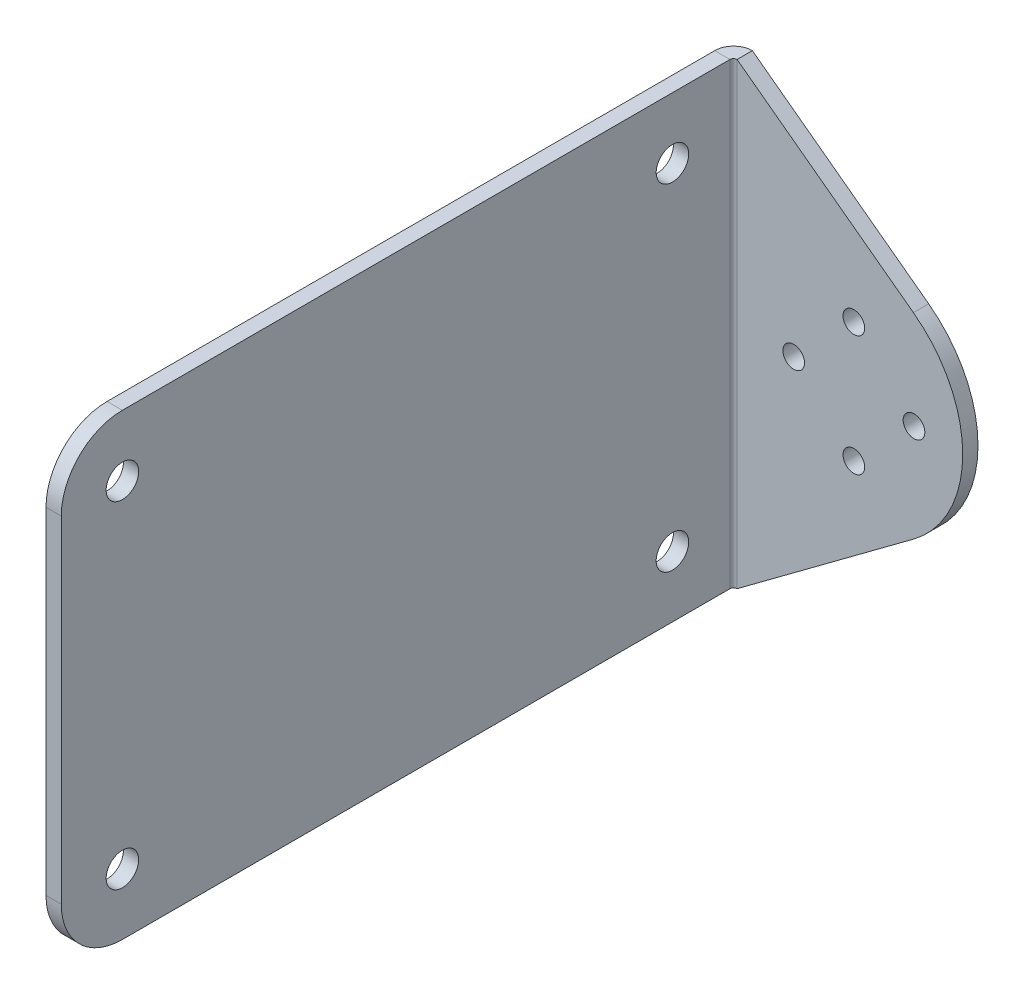
ISO-10303-21;
HEADER;
FILE_DESCRIPTION(('STEP AP214'),'2;1');
FILE_NAME('part.step','',(''),(''),'','','');
FILE_SCHEMA(('AUTOMOTIVE_DESIGN { 1 0 10303 214 1 1 1 1 }'));
ENDSEC;
DATA;
#1=APPLICATION_CONTEXT('core data for automotive mechanical design processes');
#2=APPLICATION_PROTOCOL_DEFINITION('international standard','automotive_design',2000,#1);
#3=PRODUCT_CONTEXT('',#1,'mechanical');
#4=PRODUCT('Part','Part','',(#3));
#5=PRODUCT_RELATED_PRODUCT_CATEGORY('part','',(#4));
#6=PRODUCT_DEFINITION_FORMATION('','',#4);
#7=PRODUCT_DEFINITION_CONTEXT('part definition',#1,'design');
#8=PRODUCT_DEFINITION('design','',#6,#7);
#9=PRODUCT_DEFINITION_SHAPE('','',#8);
#10=(LENGTH_UNIT() NAMED_UNIT(*) SI_UNIT(.MILLI.,.METRE.));
#11=(NAMED_UNIT(*) PLANE_ANGLE_UNIT() SI_UNIT($,.RADIAN.));
#12=(NAMED_UNIT(*) SI_UNIT($,.STERADIAN.) SOLID_ANGLE_UNIT());
#13=UNCERTAINTY_MEASURE_WITH_UNIT(LENGTH_MEASURE(1.E-05),#10,'distance_accuracy_value','');
#14=(GEOMETRIC_REPRESENTATION_CONTEXT(3) GLOBAL_UNCERTAINTY_ASSIGNED_CONTEXT((#13)) GLOBAL_UNIT_ASSIGNED_CONTEXT((#10,
#11,#12)) REPRESENTATION_CONTEXT('',''));
#15=CARTESIAN_POINT('',(0.,0.,0.));
#16=DIRECTION('',(0.,0.,1.));
#17=DIRECTION('',(1.,0.,0.));
#18=AXIS2_PLACEMENT_3D('',#15,#16,#17);
#19=CARTESIAN_POINT('',(0.,0.,0.));
#20=DIRECTION('',(-1.,0.,0.));
#21=DIRECTION('',(0.,0.,1.));
#22=AXIS2_PLACEMENT_3D('',#19,#20,#21);
#23=PLANE('',#22);
#24=CARTESIAN_POINT('',(0.,-34.925,57.15));
#25=DIRECTION('',(1.,0.,0.));
#26=DIRECTION('',(0.,0.,-1.));
#27=AXIS2_PLACEMENT_3D('',#24,#25,#26);
#28=CIRCLE('',#27,3.3782);
#29=CARTESIAN_POINT('',(0.,-34.925,53.7718));
#30=VERTEX_POINT('',#29);
#31=EDGE_CURVE('E360',#30,#30,#28,.T.);
#32=ORIENTED_EDGE('',*,*,#31,.F.);
#33=EDGE_LOOP('',(#32));
#34=FACE_BOUND('',#33,.T.);
#35=DIRECTION('',(0.,0.,1.));
#36=VECTOR('',#35,1.);
#37=CARTESIAN_POINT('',(0.,47.625,69.85));
#38=LINE('',#37,#36);
#39=CARTESIAN_POINT('',(0.,47.625,-69.1134));
#40=VERTEX_POINT('',#39);
#41=CARTESIAN_POINT('',(0.,47.625,57.15));
#42=VERTEX_POINT('',#41);
#43=EDGE_CURVE('E181',#40,#42,#38,.T.);
#44=ORIENTED_EDGE('',*,*,#43,.T.);
#45=CARTESIAN_POINT('',(0.,34.925,57.15));
#46=DIRECTION('',(-1.,0.,0.));
#47=DIRECTION('',(0.,0.,1.));
#48=AXIS2_PLACEMENT_3D('',#45,#46,#47);
#49=CIRCLE('',#48,12.7);
#50=CARTESIAN_POINT('',(0.,34.925,69.85));
#51=VERTEX_POINT('',#50);
#52=EDGE_CURVE('E203',#42,#51,#49,.F.);
#53=ORIENTED_EDGE('',*,*,#52,.T.);
#54=DIRECTION('',(0.,-1.,0.));
#55=VECTOR('',#54,1.);
#56=CARTESIAN_POINT('',(0.,-47.625,69.85));
#57=LINE('',#56,#55);
#58=CARTESIAN_POINT('',(0.,-34.925,69.85));
#59=VERTEX_POINT('',#58);
#60=EDGE_CURVE('E195',#51,#59,#57,.T.);
#61=ORIENTED_EDGE('',*,*,#60,.T.);
#62=CARTESIAN_POINT('',(0.,-34.925,57.15));
#63=DIRECTION('',(-1.,0.,0.));
#64=DIRECTION('',(0.,0.,1.));
#65=AXIS2_PLACEMENT_3D('',#62,#63,#64);
#66=CIRCLE('',#65,12.7);
#67=CARTESIAN_POINT('',(0.,-47.625,57.15));
#68=VERTEX_POINT('',#67);
#69=EDGE_CURVE('E201',#59,#68,#66,.F.);
#70=ORIENTED_EDGE('',*,*,#69,.T.);
#71=DIRECTION('',(0.,0.,-1.));
#72=VECTOR('',#71,1.);
#73=CARTESIAN_POINT('',(0.,-47.625,69.85));
#74=LINE('',#73,#72);
#75=CARTESIAN_POINT('',(0.,-47.625,-69.1134));
#76=VERTEX_POINT('',#75);
#77=EDGE_CURVE('E188',#68,#76,#74,.T.);
#78=ORIENTED_EDGE('',*,*,#77,.T.);
#79=DIRECTION('',(0.,1.,0.));
#80=VECTOR('',#79,1.);
#81=CARTESIAN_POINT('',(0.,47.625,-69.1134));
#82=LINE('',#81,#80);
#83=EDGE_CURVE('E173',#40,#76,#82,.F.);
#84=ORIENTED_EDGE('',*,*,#83,.F.);
#85=EDGE_LOOP('',(#44,#53,#61,#70,#78,#84));
#86=FACE_BOUND('',#85,.T.);
#87=CARTESIAN_POINT('',(0.,-34.925,-57.15));
#88=DIRECTION('',(1.,0.,0.));
#89=DIRECTION('',(0.,0.,-1.));
#90=AXIS2_PLACEMENT_3D('',#87,#88,#89);
#91=CIRCLE('',#90,3.3782);
#92=CARTESIAN_POINT('',(0.,-34.925,-60.5282));
#93=VERTEX_POINT('',#92);
#94=EDGE_CURVE('E366',#93,#93,#91,.T.);
#95=ORIENTED_EDGE('',*,*,#94,.F.);
#96=EDGE_LOOP('',(#95));
#97=FACE_BOUND('',#96,.T.);
#98=CARTESIAN_POINT('',(0.,34.925,-57.15));
#99=DIRECTION('',(1.,0.,0.));
#100=DIRECTION('',(0.,0.,-1.));
#101=AXIS2_PLACEMENT_3D('',#98,#99,#100);
#102=CIRCLE('',#101,3.3782);
#103=CARTESIAN_POINT('',(0.,34.925,-60.5282));
#104=VERTEX_POINT('',#103);
#105=EDGE_CURVE('E372',#104,#104,#102,.T.);
#106=ORIENTED_EDGE('',*,*,#105,.F.);
#107=EDGE_LOOP('',(#106));
#108=FACE_BOUND('',#107,.T.);
#109=CARTESIAN_POINT('',(0.,34.925,57.15));
#110=DIRECTION('',(1.,0.,0.));
#111=DIRECTION('',(0.,0.,-1.));
#112=AXIS2_PLACEMENT_3D('',#109,#110,#111);
#113=CIRCLE('',#112,3.3782);
#114=CARTESIAN_POINT('',(0.,34.925,53.7718));
#115=VERTEX_POINT('',#114);
#116=EDGE_CURVE('E378',#115,#115,#113,.T.);
#117=ORIENTED_EDGE('',*,*,#116,.F.);
#118=EDGE_LOOP('',(#117));
#119=FACE_BOUND('',#118,.T.);
#120=ADVANCED_FACE('F41',(#34,#86,#97,#108,#119),#23,.F.);
#121=CARTESIAN_POINT('',(-2.55334518668361E-13,0.,-73.025));
#122=DIRECTION('',(0.,0.,1.));
#123=DIRECTION('',(1.,0.,0.));
#124=AXIS2_PLACEMENT_3D('',#121,#122,#123);
#125=PLANE('',#124);
#126=DIRECTION('',(0.802526615940513,-0.596616317835062,0.));
#127=VECTOR('',#126,1.);
#128=CARTESIAN_POINT('',(23.065066130475,31.0255165921421,-73.0250000000001));
#129=LINE('',#128,#127);
#130=CARTESIAN_POINT('',(0.736600000000004,47.625,-73.025));
#131=VERTEX_POINT('',#130);
#132=CARTESIAN_POINT('',(37.3790544730106,20.3841760448891,-73.0250000000001));
#133=VERTEX_POINT('',#132);
#134=EDGE_CURVE('E136',#131,#133,#129,.T.);
#135=ORIENTED_EDGE('',*,*,#134,.T.);
#136=CARTESIAN_POINT('',(22.225,0.,-73.0250000000001));
#137=DIRECTION('',(0.,0.,-1.));
#138=DIRECTION('',(-1.,0.,0.));
#139=AXIS2_PLACEMENT_3D('',#136,#137,#138);
#140=CIRCLE('',#139,25.4);
#141=CARTESIAN_POINT('',(37.3790544730106,-20.384176044889,-73.0250000000001));
#142=VERTEX_POINT('',#141);
#143=EDGE_CURVE('E128',#133,#142,#140,.T.);
#144=ORIENTED_EDGE('',*,*,#143,.T.);
#145=DIRECTION('',(0.802526615940514,0.596616317835062,0.));
#146=VECTOR('',#145,1.);
#147=CARTESIAN_POINT('',(23.065066130475,-31.0255165921421,-73.0250000000001));
#148=LINE('',#147,#146);
#149=CARTESIAN_POINT('',(0.73659999999999,-47.625,-73.025));
#150=VERTEX_POINT('',#149);
#151=EDGE_CURVE('E146',#150,#142,#148,.T.);
#152=ORIENTED_EDGE('',*,*,#151,.F.);
#153=DIRECTION('',(0.,-1.,0.));
#154=VECTOR('',#153,1.);
#155=CARTESIAN_POINT('',(0.736600000000004,0.,-73.025));
#156=LINE('',#155,#154);
#157=EDGE_CURVE('E155',#131,#150,#156,.T.);
#158=ORIENTED_EDGE('',*,*,#157,.F.);
#159=EDGE_LOOP('',(#135,#144,#152,#158));
#160=FACE_BOUND('',#159,.T.);
#161=CARTESIAN_POINT('',(12.4999999999997,0.,-73.025));
#162=DIRECTION('',(0.,0.,-1.));
#163=DIRECTION('',(-1.,0.,0.));
#164=AXIS2_PLACEMENT_3D('',#161,#162,#163);
#165=CIRCLE('',#164,2.2479);
#166=CARTESIAN_POINT('',(10.2520999999997,0.,-73.025));
#167=VERTEX_POINT('',#166);
#168=EDGE_CURVE('E340',#167,#167,#165,.T.);
#169=ORIENTED_EDGE('',*,*,#168,.F.);
#170=EDGE_LOOP('',(#169));
#171=FACE_BOUND('',#170,.T.);
#172=CARTESIAN_POINT('',(24.9999999999997,12.5,-73.0250000000001));
#173=DIRECTION('',(0.,0.,-1.));
#174=DIRECTION('',(-1.,0.,0.));
#175=AXIS2_PLACEMENT_3D('',#172,#173,#174);
#176=CIRCLE('',#175,2.2479);
#177=CARTESIAN_POINT('',(22.7520999999997,12.5,-73.0250000000001));
#178=VERTEX_POINT('',#177);
#179=EDGE_CURVE('E346',#178,#178,#176,.T.);
#180=ORIENTED_EDGE('',*,*,#179,.F.);
#181=EDGE_LOOP('',(#180));
#182=FACE_BOUND('',#181,.T.);
#183=CARTESIAN_POINT('',(37.4999999999997,0.,-73.0250000000001));
#184=DIRECTION('',(0.,0.,-1.));
#185=DIRECTION('',(-1.,0.,0.));
#186=AXIS2_PLACEMENT_3D('',#183,#184,#185);
#187=CIRCLE('',#186,2.2479);
#188=CARTESIAN_POINT('',(35.2520999999997,0.,-73.0250000000001));
#189=VERTEX_POINT('',#188);
#190=EDGE_CURVE('E350',#189,#189,#187,.T.);
#191=ORIENTED_EDGE('',*,*,#190,.F.);
#192=EDGE_LOOP('',(#191));
#193=FACE_BOUND('',#192,.T.);
#194=CARTESIAN_POINT('',(24.9999999999997,-12.5,-73.0250000000001));
#195=DIRECTION('',(0.,0.,-1.));
#196=DIRECTION('',(-1.,0.,0.));
#197=AXIS2_PLACEMENT_3D('',#194,#195,#196);
#198=CIRCLE('',#197,2.2479);
#199=CARTESIAN_POINT('',(22.7520999999997,-12.5,-73.0250000000001));
#200=VERTEX_POINT('',#199);
#201=EDGE_CURVE('E354',#200,#200,#198,.T.);
#202=ORIENTED_EDGE('',*,*,#201,.F.);
#203=EDGE_LOOP('',(#202));
#204=FACE_BOUND('',#203,.T.);
#205=ADVANCED_FACE('F244',(#160,#171,#182,#193,#204),#125,.F.);
#206=CARTESIAN_POINT('',(-2.44249065417534E-13,0.,-69.85));
#207=DIRECTION('',(0.,0.,1.));
#208=DIRECTION('',(1.,0.,0.));
#209=AXIS2_PLACEMENT_3D('',#206,#207,#208);
#210=PLANE('',#209);
#211=CARTESIAN_POINT('',(24.9999999999997,-12.5,-69.8500000000001));
#212=DIRECTION('',(0.,0.,1.));
#213=DIRECTION('',(1.,0.,0.));
#214=AXIS2_PLACEMENT_3D('',#211,#212,#213);
#215=CIRCLE('',#214,2.2479);
#216=CARTESIAN_POINT('',(27.2478999999997,-12.5,-69.8500000000001));
#217=VERTEX_POINT('',#216);
#218=EDGE_CURVE('E327',#217,#217,#215,.T.);
#219=ORIENTED_EDGE('',*,*,#218,.F.);
#220=EDGE_LOOP('',(#219));
#221=FACE_BOUND('',#220,.T.);
#222=CARTESIAN_POINT('',(37.4999999999997,0.,-69.8500000000001));
#223=DIRECTION('',(0.,0.,1.));
#224=DIRECTION('',(1.,0.,0.));
#225=AXIS2_PLACEMENT_3D('',#222,#223,#224);
#226=CIRCLE('',#225,2.2479);
#227=CARTESIAN_POINT('',(39.7478999999997,0.,-69.8500000000002));
#228=VERTEX_POINT('',#227);
#229=EDGE_CURVE('E331',#228,#228,#226,.T.);
#230=ORIENTED_EDGE('',*,*,#229,.F.);
#231=EDGE_LOOP('',(#230));
#232=FACE_BOUND('',#231,.T.);
#233=CARTESIAN_POINT('',(24.9999999999997,12.5,-69.8500000000001));
#234=DIRECTION('',(0.,0.,1.));
#235=DIRECTION('',(1.,0.,0.));
#236=AXIS2_PLACEMENT_3D('',#233,#234,#235);
#237=CIRCLE('',#236,2.2479);
#238=CARTESIAN_POINT('',(27.2478999999997,12.5,-69.8500000000001));
#239=VERTEX_POINT('',#238);
#240=EDGE_CURVE('E335',#239,#239,#237,.T.);
#241=ORIENTED_EDGE('',*,*,#240,.F.);
#242=EDGE_LOOP('',(#241));
#243=FACE_BOUND('',#242,.T.);
#244=CARTESIAN_POINT('',(12.4999999999997,0.,-69.8500000000001));
#245=DIRECTION('',(0.,0.,1.));
#246=DIRECTION('',(1.,0.,0.));
#247=AXIS2_PLACEMENT_3D('',#244,#245,#246);
#248=CIRCLE('',#247,2.2479);
#249=CARTESIAN_POINT('',(14.7478999999997,0.,-69.8500000000001));
#250=VERTEX_POINT('',#249);
#251=EDGE_CURVE('E338',#250,#250,#248,.T.);
#252=ORIENTED_EDGE('',*,*,#251,.F.);
#253=EDGE_LOOP('',(#252));
#254=FACE_BOUND('',#253,.T.);
#255=CARTESIAN_POINT('',(22.225,0.,-69.8500000000001));
#256=DIRECTION('',(0.,0.,1.));
#257=DIRECTION('',(1.,0.,0.));
#258=AXIS2_PLACEMENT_3D('',#255,#256,#257);
#259=CIRCLE('',#258,25.4);
#260=CARTESIAN_POINT('',(37.3790544730111,20.3841760448887,-69.8500000000001));
#261=VERTEX_POINT('',#260);
#262=CARTESIAN_POINT('',(37.3790544730111,-20.3841760448887,-69.8500000000001));
#263=VERTEX_POINT('',#262);
#264=EDGE_CURVE('E118',#261,#263,#259,.F.);
#265=ORIENTED_EDGE('',*,*,#264,.F.);
#266=DIRECTION('',(0.802526615940513,-0.596616317835062,0.));
#267=VECTOR('',#266,1.);
#268=CARTESIAN_POINT('',(23.065066130475,31.0255165921421,-69.8500000000001));
#269=LINE('',#268,#267);
#270=CARTESIAN_POINT('',(0.736600000000015,47.625,-69.8500000000001));
#271=VERTEX_POINT('',#270);
#272=EDGE_CURVE('E123',#271,#261,#269,.T.);
#273=ORIENTED_EDGE('',*,*,#272,.F.);
#274=DIRECTION('',(0.,1.,0.));
#275=VECTOR('',#274,1.);
#276=CARTESIAN_POINT('',(0.736600000000004,-47.625,-69.85));
#277=LINE('',#276,#275);
#278=CARTESIAN_POINT('',(0.736600000000001,-47.625,-69.85));
#279=VERTEX_POINT('',#278);
#280=EDGE_CURVE('E152',#279,#271,#277,.T.);
#281=ORIENTED_EDGE('',*,*,#280,.F.);
#282=DIRECTION('',(0.802526615940514,0.596616317835062,0.));
#283=VECTOR('',#282,1.);
#284=CARTESIAN_POINT('',(23.065066130475,-31.0255165921421,-69.8500000000001));
#285=LINE('',#284,#283);
#286=EDGE_CURVE('E125',#279,#263,#285,.T.);
#287=ORIENTED_EDGE('',*,*,#286,.T.);
#288=EDGE_LOOP('',(#265,#273,#281,#287));
#289=FACE_BOUND('',#288,.T.);
#290=ADVANCED_FACE('F120',(#221,#232,#243,#254,#289),#210,.T.);
#291=CARTESIAN_POINT('',(-3.175,47.625,69.85));
#292=DIRECTION('',(0.,1.,0.));
#293=DIRECTION('',(0.,0.,1.));
#294=AXIS2_PLACEMENT_3D('',#291,#292,#293);
#295=PLANE('',#294);
#296=DIRECTION('',(0.,0.,1.));
#297=VECTOR('',#296,1.);
#298=CARTESIAN_POINT('',(-3.175,47.625,69.85));
#299=LINE('',#298,#297);
#300=CARTESIAN_POINT('',(-3.17499999999999,47.625,-69.1134));
#301=VERTEX_POINT('',#300);
#302=CARTESIAN_POINT('',(-3.175,47.625,57.15));
#303=VERTEX_POINT('',#302);
#304=EDGE_CURVE('E184',#301,#303,#299,.T.);
#305=ORIENTED_EDGE('',*,*,#304,.T.);
#306=DIRECTION('',(1.,0.,0.));
#307=VECTOR('',#306,1.);
#308=CARTESIAN_POINT('',(-3.175,47.625,57.15));
#309=LINE('',#308,#307);
#310=EDGE_CURVE('E192',#303,#42,#309,.T.);
#311=ORIENTED_EDGE('',*,*,#310,.T.);
#312=ORIENTED_EDGE('',*,*,#43,.F.);
#313=DIRECTION('',(-1.,0.,0.));
#314=VECTOR('',#313,1.);
#315=CARTESIAN_POINT('',(0.,47.625,-69.1134));
#316=LINE('',#315,#314);
#317=EDGE_CURVE('E167',#40,#301,#316,.T.);
#318=ORIENTED_EDGE('',*,*,#317,.T.);
#319=EDGE_LOOP('',(#305,#311,#312,#318));
#320=FACE_BOUND('',#319,.T.);
#321=ADVANCED_FACE('F217',(#320),#295,.T.);
#322=CARTESIAN_POINT('',(-3.175,0.,0.));
#323=DIRECTION('',(-1.,0.,0.));
#324=DIRECTION('',(0.,0.,1.));
#325=AXIS2_PLACEMENT_3D('',#322,#323,#324);
#326=PLANE('',#325);
#327=CARTESIAN_POINT('',(-3.175,34.925,57.15));
#328=DIRECTION('',(-1.,0.,0.));
#329=DIRECTION('',(0.,0.,1.));
#330=AXIS2_PLACEMENT_3D('',#327,#328,#329);
#331=CIRCLE('',#330,3.3782);
#332=CARTESIAN_POINT('',(-3.175,34.925,60.5282));
#333=VERTEX_POINT('',#332);
#334=EDGE_CURVE('E375',#333,#333,#331,.T.);
#335=ORIENTED_EDGE('',*,*,#334,.F.);
#336=EDGE_LOOP('',(#335));
#337=FACE_BOUND('',#336,.T.);
#338=CARTESIAN_POINT('',(-3.175,34.925,-57.15));
#339=DIRECTION('',(-1.,0.,0.));
#340=DIRECTION('',(0.,0.,1.));
#341=AXIS2_PLACEMENT_3D('',#338,#339,#340);
#342=CIRCLE('',#341,3.3782);
#343=CARTESIAN_POINT('',(-3.175,34.925,-53.7718));
#344=VERTEX_POINT('',#343);
#345=EDGE_CURVE('E369',#344,#344,#342,.T.);
#346=ORIENTED_EDGE('',*,*,#345,.F.);
#347=EDGE_LOOP('',(#346));
#348=FACE_BOUND('',#347,.T.);
#349=CARTESIAN_POINT('',(-3.175,-34.925,-57.15));
#350=DIRECTION('',(-1.,0.,0.));
#351=DIRECTION('',(0.,0.,1.));
#352=AXIS2_PLACEMENT_3D('',#349,#350,#351);
#353=CIRCLE('',#352,3.3782);
#354=CARTESIAN_POINT('',(-3.175,-34.925,-53.7718));
#355=VERTEX_POINT('',#354);
#356=EDGE_CURVE('E363',#355,#355,#353,.T.);
#357=ORIENTED_EDGE('',*,*,#356,.F.);
#358=EDGE_LOOP('',(#357));
#359=FACE_BOUND('',#358,.T.);
#360=CARTESIAN_POINT('',(-3.175,-34.925,57.15));
#361=DIRECTION('',(-1.,0.,0.));
#362=DIRECTION('',(0.,0.,1.));
#363=AXIS2_PLACEMENT_3D('',#360,#361,#362);
#364=CIRCLE('',#363,3.3782);
#365=CARTESIAN_POINT('',(-3.175,-34.925,60.5282));
#366=VERTEX_POINT('',#365);
#367=EDGE_CURVE('E357',#366,#366,#364,.T.);
#368=ORIENTED_EDGE('',*,*,#367,.F.);
#369=EDGE_LOOP('',(#368));
#370=FACE_BOUND('',#369,.T.);
#371=DIRECTION('',(0.,-1.,0.));
#372=VECTOR('',#371,1.);
#373=CARTESIAN_POINT('',(-3.175,-47.625,69.85));
#374=LINE('',#373,#372);
#375=CARTESIAN_POINT('',(-3.175,34.925,69.85));
#376=VERTEX_POINT('',#375);
#377=CARTESIAN_POINT('',(-3.175,-34.925,69.85));
#378=VERTEX_POINT('',#377);
#379=EDGE_CURVE('E187',#376,#378,#374,.T.);
#380=ORIENTED_EDGE('',*,*,#379,.F.);
#381=CARTESIAN_POINT('',(-3.175,34.925,57.15));
#382=DIRECTION('',(-1.,0.,0.));
#383=DIRECTION('',(0.,0.,1.));
#384=AXIS2_PLACEMENT_3D('',#381,#382,#383);
#385=CIRCLE('',#384,12.7);
#386=EDGE_CURVE('E49',#376,#303,#385,.T.);
#387=ORIENTED_EDGE('',*,*,#386,.T.);
#388=ORIENTED_EDGE('',*,*,#304,.F.);
#389=DIRECTION('',(0.,1.,0.));
#390=VECTOR('',#389,1.);
#391=CARTESIAN_POINT('',(-3.17499999999999,47.625,-69.1134));
#392=LINE('',#391,#390);
#393=CARTESIAN_POINT('',(-3.175,-47.625,-69.1134));
#394=VERTEX_POINT('',#393);
#395=EDGE_CURVE('E160',#301,#394,#392,.F.);
#396=ORIENTED_EDGE('',*,*,#395,.T.);
#397=DIRECTION('',(0.,0.,-1.));
#398=VECTOR('',#397,1.);
#399=CARTESIAN_POINT('',(-3.175,-47.625,69.85));
#400=LINE('',#399,#398);
#401=CARTESIAN_POINT('',(-3.175,-47.625,57.15));
#402=VERTEX_POINT('',#401);
#403=EDGE_CURVE('E190',#402,#394,#400,.T.);
#404=ORIENTED_EDGE('',*,*,#403,.F.);
#405=CARTESIAN_POINT('',(-3.175,-34.925,57.15));
#406=DIRECTION('',(-1.,0.,0.));
#407=DIRECTION('',(0.,0.,1.));
#408=AXIS2_PLACEMENT_3D('',#405,#406,#407);
#409=CIRCLE('',#408,12.7);
#410=EDGE_CURVE('E61',#402,#378,#409,.T.);
#411=ORIENTED_EDGE('',*,*,#410,.T.);
#412=EDGE_LOOP('',(#380,#387,#388,#396,#404,#411));
#413=FACE_BOUND('',#412,.T.);
#414=ADVANCED_FACE('F212',(#337,#348,#359,#370,#413),#326,.T.);
#415=CARTESIAN_POINT('',(-3.175,-47.625,69.85));
#416=DIRECTION('',(0.,-1.,0.));
#417=DIRECTION('',(0.,0.,-1.));
#418=AXIS2_PLACEMENT_3D('',#415,#416,#417);
#419=PLANE('',#418);
#420=ORIENTED_EDGE('',*,*,#77,.F.);
#421=DIRECTION('',(1.,0.,0.));
#422=VECTOR('',#421,1.);
#423=CARTESIAN_POINT('',(-3.175,-47.625,57.15));
#424=LINE('',#423,#422);
#425=EDGE_CURVE('E11',#68,#402,#424,.F.);
#426=ORIENTED_EDGE('',*,*,#425,.T.);
#427=ORIENTED_EDGE('',*,*,#403,.T.);
#428=DIRECTION('',(-1.,0.,0.));
#429=VECTOR('',#428,1.);
#430=CARTESIAN_POINT('',(0.,-47.625,-69.1134));
#431=LINE('',#430,#429);
#432=EDGE_CURVE('E178',#76,#394,#431,.T.);
#433=ORIENTED_EDGE('',*,*,#432,.F.);
#434=EDGE_LOOP('',(#420,#426,#427,#433));
#435=FACE_BOUND('',#434,.T.);
#436=ADVANCED_FACE('F229',(#435),#419,.T.);
#437=CARTESIAN_POINT('',(-3.175,-47.625,69.85));
#438=DIRECTION('',(0.,0.,1.));
#439=DIRECTION('',(1.,0.,0.));
#440=AXIS2_PLACEMENT_3D('',#437,#438,#439);
#441=PLANE('',#440);
#442=ORIENTED_EDGE('',*,*,#60,.F.);
#443=DIRECTION('',(1.,0.,0.));
#444=VECTOR('',#443,1.);
#445=CARTESIAN_POINT('',(-3.175,34.925,69.85));
#446=LINE('',#445,#444);
#447=EDGE_CURVE('E208',#51,#376,#446,.F.);
#448=ORIENTED_EDGE('',*,*,#447,.T.);
#449=ORIENTED_EDGE('',*,*,#379,.T.);
#450=DIRECTION('',(1.,0.,0.));
#451=VECTOR('',#450,1.);
#452=CARTESIAN_POINT('',(-3.175,-34.925,69.85));
#453=LINE('',#452,#451);
#454=EDGE_CURVE('E205',#378,#59,#453,.T.);
#455=ORIENTED_EDGE('',*,*,#454,.T.);
#456=EDGE_LOOP('',(#442,#448,#449,#455));
#457=FACE_BOUND('',#456,.T.);
#458=ADVANCED_FACE('F225',(#457),#441,.T.);
#459=CARTESIAN_POINT('',(0.736600000000004,-47.625,-69.1134));
#460=DIRECTION('',(0.,-1.,0.));
#461=DIRECTION('',(0.,0.,-1.));
#462=AXIS2_PLACEMENT_3D('',#459,#460,#461);
#463=PLANE('',#462);
#464=DIRECTION('',(0.,0.,-1.));
#465=VECTOR('',#464,1.);
#466=CARTESIAN_POINT('',(0.736600000000004,-47.625,-69.85));
#467=LINE('',#466,#465);
#468=EDGE_CURVE('E151',#279,#150,#467,.T.);
#469=ORIENTED_EDGE('',*,*,#468,.F.);
#470=CARTESIAN_POINT('',(0.736600000000004,-47.625,-69.1134));
#471=DIRECTION('',(0.,1.,0.));
#472=DIRECTION('',(0.,0.,1.));
#473=AXIS2_PLACEMENT_3D('',#470,#471,#472);
#474=CIRCLE('',#473,0.73659999999999);
#475=EDGE_CURVE('E170',#76,#279,#474,.F.);
#476=ORIENTED_EDGE('',*,*,#475,.F.);
#477=ORIENTED_EDGE('',*,*,#432,.T.);
#478=CARTESIAN_POINT('',(0.736600000000004,-47.625,-69.1134));
#479=DIRECTION('',(0.,1.,0.));
#480=DIRECTION('',(0.,0.,1.));
#481=AXIS2_PLACEMENT_3D('',#478,#479,#480);
#482=CIRCLE('',#481,3.91159999999999);
#483=EDGE_CURVE('E163',#394,#150,#482,.F.);
#484=ORIENTED_EDGE('',*,*,#483,.T.);
#485=EDGE_LOOP('',(#469,#476,#477,#484));
#486=FACE_BOUND('',#485,.T.);
#487=ADVANCED_FACE('F234',(#486),#463,.T.);
#488=CARTESIAN_POINT('',(0.736600000000004,47.625,-69.1134));
#489=DIRECTION('',(0.,-1.,0.));
#490=DIRECTION('',(0.,0.,-1.));
#491=AXIS2_PLACEMENT_3D('',#488,#489,#490);
#492=PLANE('',#491);
#493=CARTESIAN_POINT('',(0.736600000000004,47.625,-69.1134));
#494=DIRECTION('',(0.,1.,0.));
#495=DIRECTION('',(0.,0.,1.));
#496=AXIS2_PLACEMENT_3D('',#493,#494,#495);
#497=CIRCLE('',#496,0.73659999999999);
#498=EDGE_CURVE('E159',#271,#40,#497,.T.);
#499=ORIENTED_EDGE('',*,*,#498,.F.);
#500=DIRECTION('',(0.,0.,-1.));
#501=VECTOR('',#500,1.);
#502=CARTESIAN_POINT('',(0.736600000000004,47.625,-69.85));
#503=LINE('',#502,#501);
#504=EDGE_CURVE('E140',#271,#131,#503,.T.);
#505=ORIENTED_EDGE('',*,*,#504,.T.);
#506=CARTESIAN_POINT('',(0.736600000000004,47.625,-69.1134));
#507=DIRECTION('',(0.,1.,0.));
#508=DIRECTION('',(0.,0.,1.));
#509=AXIS2_PLACEMENT_3D('',#506,#507,#508);
#510=CIRCLE('',#509,3.91159999999999);
#511=EDGE_CURVE('E164',#131,#301,#510,.T.);
#512=ORIENTED_EDGE('',*,*,#511,.T.);
#513=ORIENTED_EDGE('',*,*,#317,.F.);
#514=EDGE_LOOP('',(#499,#505,#512,#513));
#515=FACE_BOUND('',#514,.T.);
#516=ADVANCED_FACE('F240',(#515),#492,.F.);
#517=CARTESIAN_POINT('',(0.736600000000004,47.625,-69.1134));
#518=DIRECTION('',(0.,1.,0.));
#519=DIRECTION('',(0.,0.,-1.));
#520=AXIS2_PLACEMENT_3D('',#517,#518,#519);
#521=CYLINDRICAL_SURFACE('',#520,3.91159999999999);
#522=ORIENTED_EDGE('',*,*,#395,.F.);
#523=ORIENTED_EDGE('',*,*,#511,.F.);
#524=ORIENTED_EDGE('',*,*,#157,.T.);
#525=ORIENTED_EDGE('',*,*,#483,.F.);
#526=EDGE_LOOP('',(#522,#523,#524,#525));
#527=FACE_BOUND('',#526,.T.);
#528=ADVANCED_FACE('F237',(#527),#521,.T.);
#529=CARTESIAN_POINT('',(0.736600000000004,47.625,-69.1134));
#530=DIRECTION('',(0.,1.,0.));
#531=DIRECTION('',(0.,0.,-1.));
#532=AXIS2_PLACEMENT_3D('',#529,#530,#531);
#533=CYLINDRICAL_SURFACE('',#532,0.73659999999999);
#534=ORIENTED_EDGE('',*,*,#83,.T.);
#535=ORIENTED_EDGE('',*,*,#475,.T.);
#536=ORIENTED_EDGE('',*,*,#280,.T.);
#537=ORIENTED_EDGE('',*,*,#498,.T.);
#538=EDGE_LOOP('',(#534,#535,#536,#537));
#539=FACE_BOUND('',#538,.T.);
#540=ADVANCED_FACE('F249',(#539),#533,.F.);
#541=CARTESIAN_POINT('',(22.2250000000005,0.,69.8510000000001));
#542=DIRECTION('',(0.,0.,-1.));
#543=DIRECTION('',(-1.,0.,0.));
#544=AXIS2_PLACEMENT_3D('',#541,#542,#543);
#545=CYLINDRICAL_SURFACE('',#544,25.4);
#546=ORIENTED_EDGE('',*,*,#264,.T.);
#547=DIRECTION('',(0.,0.,-1.));
#548=VECTOR('',#547,1.);
#549=CARTESIAN_POINT('',(37.3790544730111,-20.384176044889,69.851));
#550=LINE('',#549,#548);
#551=EDGE_CURVE('E149',#263,#142,#550,.T.);
#552=ORIENTED_EDGE('',*,*,#551,.T.);
#553=ORIENTED_EDGE('',*,*,#143,.F.);
#554=DIRECTION('',(0.,0.,-1.));
#555=VECTOR('',#554,1.);
#556=CARTESIAN_POINT('',(37.3790544730111,20.3841760448891,69.851));
#557=LINE('',#556,#555);
#558=EDGE_CURVE('E131',#261,#133,#557,.T.);
#559=ORIENTED_EDGE('',*,*,#558,.F.);
#560=EDGE_LOOP('',(#546,#552,#553,#559));
#561=FACE_BOUND('',#560,.T.);
#562=ADVANCED_FACE('F132',(#561),#545,.T.);
#563=CARTESIAN_POINT('',(23.0650661304755,-31.0255165921421,69.8510000000001));
#564=DIRECTION('',(-0.596616317835062,0.802526615940513,0.));
#565=DIRECTION('',(-0.802526615940514,-0.596616317835062,0.));
#566=AXIS2_PLACEMENT_3D('',#563,#564,#565);
#567=PLANE('',#566);
#568=ORIENTED_EDGE('',*,*,#468,.T.);
#569=ORIENTED_EDGE('',*,*,#151,.T.);
#570=ORIENTED_EDGE('',*,*,#551,.F.);
#571=ORIENTED_EDGE('',*,*,#286,.F.);
#572=EDGE_LOOP('',(#568,#569,#570,#571));
#573=FACE_BOUND('',#572,.T.);
#574=ADVANCED_FACE('F247',(#573),#567,.F.);
#575=CARTESIAN_POINT('',(23.0650661304755,31.0255165921421,69.8510000000001));
#576=DIRECTION('',(0.596616317835062,0.802526615940513,0.));
#577=DIRECTION('',(-0.802526615940513,0.596616317835062,0.));
#578=AXIS2_PLACEMENT_3D('',#575,#576,#577);
#579=PLANE('',#578);
#580=ORIENTED_EDGE('',*,*,#272,.T.);
#581=ORIENTED_EDGE('',*,*,#558,.T.);
#582=ORIENTED_EDGE('',*,*,#134,.F.);
#583=ORIENTED_EDGE('',*,*,#504,.F.);
#584=EDGE_LOOP('',(#580,#581,#582,#583));
#585=FACE_BOUND('',#584,.T.);
#586=ADVANCED_FACE('F138',(#585),#579,.T.);
#587=CARTESIAN_POINT('',(12.4999999999997,0.,-73.025));
#588=DIRECTION('',(0.,0.,-1.));
#589=DIRECTION('',(-1.,0.,0.));
#590=AXIS2_PLACEMENT_3D('',#587,#588,#589);
#591=CYLINDRICAL_SURFACE('',#590,2.2479);
#592=ORIENTED_EDGE('',*,*,#168,.T.);
#593=EDGE_LOOP('',(#592));
#594=FACE_BOUND('',#593,.T.);
#595=ORIENTED_EDGE('',*,*,#251,.T.);
#596=EDGE_LOOP('',(#595));
#597=FACE_BOUND('',#596,.T.);
#598=ADVANCED_FACE('F311',(#594,#597),#591,.F.);
#599=CARTESIAN_POINT('',(24.9999999999997,12.5,-73.0250000000001));
#600=DIRECTION('',(0.,0.,-1.));
#601=DIRECTION('',(-1.,0.,0.));
#602=AXIS2_PLACEMENT_3D('',#599,#600,#601);
#603=CYLINDRICAL_SURFACE('',#602,2.2479);
#604=ORIENTED_EDGE('',*,*,#179,.T.);
#605=EDGE_LOOP('',(#604));
#606=FACE_BOUND('',#605,.T.);
#607=ORIENTED_EDGE('',*,*,#240,.T.);
#608=EDGE_LOOP('',(#607));
#609=FACE_BOUND('',#608,.T.);
#610=ADVANCED_FACE('F307',(#606,#609),#603,.F.);
#611=CARTESIAN_POINT('',(37.4999999999997,0.,-73.0250000000001));
#612=DIRECTION('',(0.,0.,-1.));
#613=DIRECTION('',(-1.,0.,0.));
#614=AXIS2_PLACEMENT_3D('',#611,#612,#613);
#615=CYLINDRICAL_SURFACE('',#614,2.2479);
#616=ORIENTED_EDGE('',*,*,#190,.T.);
#617=EDGE_LOOP('',(#616));
#618=FACE_BOUND('',#617,.T.);
#619=ORIENTED_EDGE('',*,*,#229,.T.);
#620=EDGE_LOOP('',(#619));
#621=FACE_BOUND('',#620,.T.);
#622=ADVANCED_FACE('F303',(#618,#621),#615,.F.);
#623=CARTESIAN_POINT('',(24.9999999999997,-12.5,-73.0250000000001));
#624=DIRECTION('',(0.,0.,-1.));
#625=DIRECTION('',(-1.,0.,0.));
#626=AXIS2_PLACEMENT_3D('',#623,#624,#625);
#627=CYLINDRICAL_SURFACE('',#626,2.2479);
#628=ORIENTED_EDGE('',*,*,#201,.T.);
#629=EDGE_LOOP('',(#628));
#630=FACE_BOUND('',#629,.T.);
#631=ORIENTED_EDGE('',*,*,#218,.T.);
#632=EDGE_LOOP('',(#631));
#633=FACE_BOUND('',#632,.T.);
#634=ADVANCED_FACE('F299',(#630,#633),#627,.F.);
#635=CARTESIAN_POINT('',(0.,-34.925,57.15));
#636=DIRECTION('',(1.,0.,0.));
#637=DIRECTION('',(0.,0.,-1.));
#638=AXIS2_PLACEMENT_3D('',#635,#636,#637);
#639=CYLINDRICAL_SURFACE('',#638,3.3782);
#640=ORIENTED_EDGE('',*,*,#31,.T.);
#641=EDGE_LOOP('',(#640));
#642=FACE_BOUND('',#641,.T.);
#643=ORIENTED_EDGE('',*,*,#367,.T.);
#644=EDGE_LOOP('',(#643));
#645=FACE_BOUND('',#644,.T.);
#646=ADVANCED_FACE('F295',(#642,#645),#639,.F.);
#647=CARTESIAN_POINT('',(0.,-34.925,-57.15));
#648=DIRECTION('',(1.,0.,0.));
#649=DIRECTION('',(0.,0.,-1.));
#650=AXIS2_PLACEMENT_3D('',#647,#648,#649);
#651=CYLINDRICAL_SURFACE('',#650,3.3782);
#652=ORIENTED_EDGE('',*,*,#94,.T.);
#653=EDGE_LOOP('',(#652));
#654=FACE_BOUND('',#653,.T.);
#655=ORIENTED_EDGE('',*,*,#356,.T.);
#656=EDGE_LOOP('',(#655));
#657=FACE_BOUND('',#656,.T.);
#658=ADVANCED_FACE('F287',(#654,#657),#651,.F.);
#659=CARTESIAN_POINT('',(0.,34.925,-57.15));
#660=DIRECTION('',(1.,0.,0.));
#661=DIRECTION('',(0.,0.,-1.));
#662=AXIS2_PLACEMENT_3D('',#659,#660,#661);
#663=CYLINDRICAL_SURFACE('',#662,3.3782);
#664=ORIENTED_EDGE('',*,*,#105,.T.);
#665=EDGE_LOOP('',(#664));
#666=FACE_BOUND('',#665,.T.);
#667=ORIENTED_EDGE('',*,*,#345,.T.);
#668=EDGE_LOOP('',(#667));
#669=FACE_BOUND('',#668,.T.);
#670=ADVANCED_FACE('F281',(#666,#669),#663,.F.);
#671=CARTESIAN_POINT('',(0.,34.925,57.15));
#672=DIRECTION('',(1.,0.,0.));
#673=DIRECTION('',(0.,0.,-1.));
#674=AXIS2_PLACEMENT_3D('',#671,#672,#673);
#675=CYLINDRICAL_SURFACE('',#674,3.3782);
#676=ORIENTED_EDGE('',*,*,#116,.T.);
#677=EDGE_LOOP('',(#676));
#678=FACE_BOUND('',#677,.T.);
#679=ORIENTED_EDGE('',*,*,#334,.T.);
#680=EDGE_LOOP('',(#679));
#681=FACE_BOUND('',#680,.T.);
#682=ADVANCED_FACE('F276',(#678,#681),#675,.F.);
#683=CARTESIAN_POINT('',(-3.175,34.925,57.15));
#684=DIRECTION('',(1.,0.,0.));
#685=DIRECTION('',(0.,0.,-1.));
#686=AXIS2_PLACEMENT_3D('',#683,#684,#685);
#687=CYLINDRICAL_SURFACE('',#686,12.7);
#688=ORIENTED_EDGE('',*,*,#386,.F.);
#689=ORIENTED_EDGE('',*,*,#447,.F.);
#690=ORIENTED_EDGE('',*,*,#52,.F.);
#691=ORIENTED_EDGE('',*,*,#310,.F.);
#692=EDGE_LOOP('',(#688,#689,#690,#691));
#693=FACE_BOUND('',#692,.T.);
#694=ADVANCED_FACE('F219',(#693),#687,.T.);
#695=CARTESIAN_POINT('',(-3.175,-34.925,57.15));
#696=DIRECTION('',(1.,0.,0.));
#697=DIRECTION('',(0.,0.,-1.));
#698=AXIS2_PLACEMENT_3D('',#695,#696,#697);
#699=CYLINDRICAL_SURFACE('',#698,12.7);
#700=ORIENTED_EDGE('',*,*,#410,.F.);
#701=ORIENTED_EDGE('',*,*,#425,.F.);
#702=ORIENTED_EDGE('',*,*,#69,.F.);
#703=ORIENTED_EDGE('',*,*,#454,.F.);
#704=EDGE_LOOP('',(#700,#701,#702,#703));
#705=FACE_BOUND('',#704,.T.);
#706=ADVANCED_FACE('F43',(#705),#699,.T.);
#707=CLOSED_SHELL('',(#120,#205,#290,#321,#414,#436,#458,#487,#516,#528,#540,#562,#574,#586,
#598,#610,#622,#634,#646,#658,#670,#682,#694,#706));
#708=MANIFOLD_SOLID_BREP('B2',#707);
#709=ADVANCED_BREP_SHAPE_REPRESENTATION('',(#18,#708),#14);
#710=SHAPE_DEFINITION_REPRESENTATION(#9,#709);
ENDSEC;
END-ISO-10303-21;
